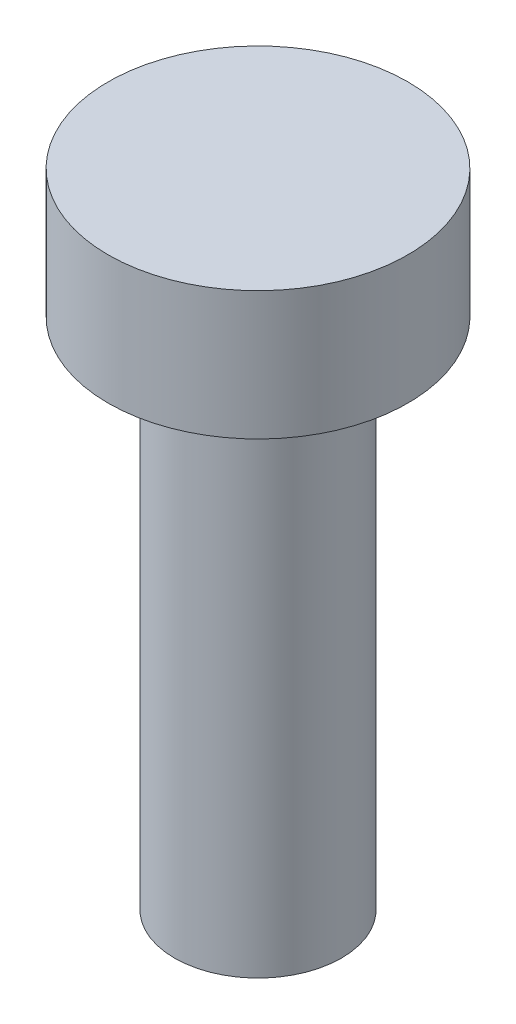
ISO-10303-21;
HEADER;
FILE_DESCRIPTION(('STEP AP214'),'2;1');
FILE_NAME('part.step','',(''),(''),'','','');
FILE_SCHEMA(('AUTOMOTIVE_DESIGN { 1 0 10303 214 1 1 1 1 }'));
ENDSEC;
DATA;
#1=APPLICATION_CONTEXT('core data for automotive mechanical design processes');
#2=APPLICATION_PROTOCOL_DEFINITION('international standard','automotive_design',2000,#1);
#3=PRODUCT_CONTEXT('',#1,'mechanical');
#4=PRODUCT('Part','Part','',(#3));
#5=PRODUCT_RELATED_PRODUCT_CATEGORY('part','',(#4));
#6=PRODUCT_DEFINITION_FORMATION('','',#4);
#7=PRODUCT_DEFINITION_CONTEXT('part definition',#1,'design');
#8=PRODUCT_DEFINITION('design','',#6,#7);
#9=PRODUCT_DEFINITION_SHAPE('','',#8);
#10=(LENGTH_UNIT() NAMED_UNIT(*) SI_UNIT(.MILLI.,.METRE.));
#11=(NAMED_UNIT(*) PLANE_ANGLE_UNIT() SI_UNIT($,.RADIAN.));
#12=(NAMED_UNIT(*) SI_UNIT($,.STERADIAN.) SOLID_ANGLE_UNIT());
#13=UNCERTAINTY_MEASURE_WITH_UNIT(LENGTH_MEASURE(1.E-05),#10,'distance_accuracy_value','');
#14=(GEOMETRIC_REPRESENTATION_CONTEXT(3) GLOBAL_UNCERTAINTY_ASSIGNED_CONTEXT((#13)) GLOBAL_UNIT_ASSIGNED_CONTEXT((#10,
#11,#12)) REPRESENTATION_CONTEXT('',''));
#15=CARTESIAN_POINT('',(0.,0.,0.));
#16=DIRECTION('',(0.,0.,1.));
#17=DIRECTION('',(1.,0.,0.));
#18=AXIS2_PLACEMENT_3D('',#15,#16,#17);
#19=CARTESIAN_POINT('',(0.,3.,0.));
#20=DIRECTION('',(0.,-1.,0.));
#21=DIRECTION('',(0.,0.,-1.));
#22=AXIS2_PLACEMENT_3D('',#19,#20,#21);
#23=CYLINDRICAL_SURFACE('',#22,3.5);
#24=CARTESIAN_POINT('',(0.,3.,0.));
#25=DIRECTION('',(0.,1.,0.));
#26=DIRECTION('',(0.,0.,1.));
#27=AXIS2_PLACEMENT_3D('',#24,#25,#26);
#28=CIRCLE('',#27,3.5);
#29=CARTESIAN_POINT('',(0.,3.,3.5));
#30=VERTEX_POINT('',#29);
#31=EDGE_CURVE('E39',#30,#30,#28,.T.);
#32=ORIENTED_EDGE('',*,*,#31,.F.);
#33=EDGE_LOOP('',(#32));
#34=FACE_BOUND('',#33,.T.);
#35=CARTESIAN_POINT('',(0.,0.,0.));
#36=DIRECTION('',(0.,1.,0.));
#37=DIRECTION('',(0.,0.,1.));
#38=AXIS2_PLACEMENT_3D('',#35,#36,#37);
#39=CIRCLE('',#38,3.5);
#40=CARTESIAN_POINT('',(0.,0.,3.5));
#41=VERTEX_POINT('',#40);
#42=EDGE_CURVE('E35',#41,#41,#39,.T.);
#43=ORIENTED_EDGE('',*,*,#42,.T.);
#44=EDGE_LOOP('',(#43));
#45=FACE_BOUND('',#44,.T.);
#46=ADVANCED_FACE('F32',(#34,#45),#23,.T.);
#47=CARTESIAN_POINT('',(0.,3.,0.));
#48=DIRECTION('',(0.,1.,0.));
#49=DIRECTION('',(0.,0.,1.));
#50=AXIS2_PLACEMENT_3D('',#47,#48,#49);
#51=PLANE('',#50);
#52=ORIENTED_EDGE('',*,*,#31,.T.);
#53=EDGE_LOOP('',(#52));
#54=FACE_BOUND('',#53,.T.);
#55=ADVANCED_FACE('F56',(#54),#51,.T.);
#56=CARTESIAN_POINT('',(0.,0.,0.));
#57=DIRECTION('',(0.,1.,0.));
#58=DIRECTION('',(0.,0.,1.));
#59=AXIS2_PLACEMENT_3D('',#56,#57,#58);
#60=PLANE('',#59);
#61=CARTESIAN_POINT('',(0.,0.,0.));
#62=DIRECTION('',(0.,-1.,0.));
#63=DIRECTION('',(0.,0.,-1.));
#64=AXIS2_PLACEMENT_3D('',#61,#62,#63);
#65=CIRCLE('',#64,1.95);
#66=CARTESIAN_POINT('',(0.,0.,-1.95));
#67=VERTEX_POINT('',#66);
#68=EDGE_CURVE('E10',#67,#67,#65,.T.);
#69=ORIENTED_EDGE('',*,*,#68,.F.);
#70=EDGE_LOOP('',(#69));
#71=FACE_BOUND('',#70,.T.);
#72=ORIENTED_EDGE('',*,*,#42,.F.);
#73=EDGE_LOOP('',(#72));
#74=FACE_BOUND('',#73,.T.);
#75=ADVANCED_FACE('F53',(#71,#74),#60,.F.);
#76=CARTESIAN_POINT('',(0.,-12.,0.));
#77=DIRECTION('',(0.,1.,0.));
#78=DIRECTION('',(0.,0.,1.));
#79=AXIS2_PLACEMENT_3D('',#76,#77,#78);
#80=CYLINDRICAL_SURFACE('',#79,1.95);
#81=CARTESIAN_POINT('',(0.,-12.,0.));
#82=DIRECTION('',(0.,-1.,0.));
#83=DIRECTION('',(0.,0.,-1.));
#84=AXIS2_PLACEMENT_3D('',#81,#82,#83);
#85=CIRCLE('',#84,1.95);
#86=CARTESIAN_POINT('',(0.,-12.,-1.95));
#87=VERTEX_POINT('',#86);
#88=EDGE_CURVE('E45',#87,#87,#85,.T.);
#89=ORIENTED_EDGE('',*,*,#88,.F.);
#90=EDGE_LOOP('',(#89));
#91=FACE_BOUND('',#90,.T.);
#92=ORIENTED_EDGE('',*,*,#68,.T.);
#93=EDGE_LOOP('',(#92));
#94=FACE_BOUND('',#93,.T.);
#95=ADVANCED_FACE('F55',(#91,#94),#80,.T.);
#96=CARTESIAN_POINT('',(0.,-12.,0.));
#97=DIRECTION('',(0.,-1.,0.));
#98=DIRECTION('',(0.,0.,-1.));
#99=AXIS2_PLACEMENT_3D('',#96,#97,#98);
#100=PLANE('',#99);
#101=ORIENTED_EDGE('',*,*,#88,.T.);
#102=EDGE_LOOP('',(#101));
#103=FACE_BOUND('',#102,.T.);
#104=ADVANCED_FACE('F62',(#103),#100,.T.);
#105=CLOSED_SHELL('',(#46,#55,#75,#95,#104));
#106=MANIFOLD_SOLID_BREP('B2',#105);
#107=ADVANCED_BREP_SHAPE_REPRESENTATION('',(#18,#106),#14);
#108=SHAPE_DEFINITION_REPRESENTATION(#9,#107);
ENDSEC;
END-ISO-10303-21;
